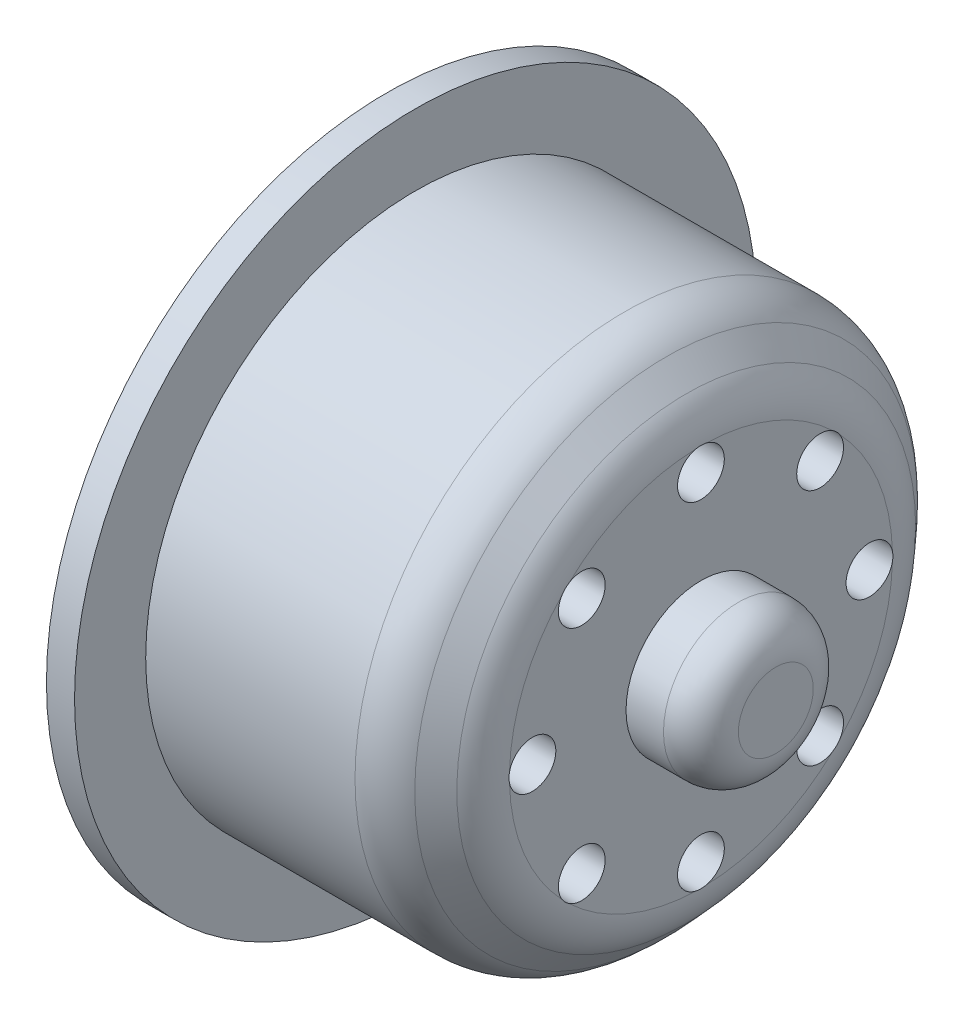
ISO-10303-21;
HEADER;
FILE_DESCRIPTION(('STEP AP214'),'2;1');
FILE_NAME('part.step','',(''),(''),'','','');
FILE_SCHEMA(('AUTOMOTIVE_DESIGN { 1 0 10303 214 1 1 1 1 }'));
ENDSEC;
DATA;
#1=APPLICATION_CONTEXT('core data for automotive mechanical design processes');
#2=APPLICATION_PROTOCOL_DEFINITION('international standard','automotive_design',2000,#1);
#3=PRODUCT_CONTEXT('',#1,'mechanical');
#4=PRODUCT('Part','Part','',(#3));
#5=PRODUCT_RELATED_PRODUCT_CATEGORY('part','',(#4));
#6=PRODUCT_DEFINITION_FORMATION('','',#4);
#7=PRODUCT_DEFINITION_CONTEXT('part definition',#1,'design');
#8=PRODUCT_DEFINITION('design','',#6,#7);
#9=PRODUCT_DEFINITION_SHAPE('','',#8);
#10=(LENGTH_UNIT() NAMED_UNIT(*) SI_UNIT(.MILLI.,.METRE.));
#11=(NAMED_UNIT(*) PLANE_ANGLE_UNIT() SI_UNIT($,.RADIAN.));
#12=(NAMED_UNIT(*) SI_UNIT($,.STERADIAN.) SOLID_ANGLE_UNIT());
#13=UNCERTAINTY_MEASURE_WITH_UNIT(LENGTH_MEASURE(1.E-05),#10,'distance_accuracy_value','');
#14=(GEOMETRIC_REPRESENTATION_CONTEXT(3) GLOBAL_UNCERTAINTY_ASSIGNED_CONTEXT((#13)) GLOBAL_UNIT_ASSIGNED_CONTEXT((#10,
#11,#12)) REPRESENTATION_CONTEXT('',''));
#15=CARTESIAN_POINT('',(0.,0.,0.));
#16=DIRECTION('',(0.,0.,1.));
#17=DIRECTION('',(1.,0.,0.));
#18=AXIS2_PLACEMENT_3D('',#15,#16,#17);
#19=CARTESIAN_POINT('',(-9.66596868854574,6.36396103067838,6.3639610306787));
#20=DIRECTION('',(1.,0.,0.));
#21=DIRECTION('',(0.,0.,-1.));
#22=AXIS2_PLACEMENT_3D('',#19,#20,#21);
#23=CYLINDRICAL_SURFACE('',#22,1.25000000000048);
#24=CARTESIAN_POINT('',(10.6195652173913,6.36396103067838,6.3639610306787));
#25=DIRECTION('',(1.,0.,0.));
#26=DIRECTION('',(0.,0.,-1.));
#27=AXIS2_PLACEMENT_3D('',#24,#25,#26);
#28=CIRCLE('',#27,1.25000000000048);
#29=CARTESIAN_POINT('',(10.6195652173913,7.04596741641522,7.41151403163636));
#30=VERTEX_POINT('',#29);
#31=CARTESIAN_POINT('',(10.6195652173913,7.411514031636,7.04596741641559));
#32=VERTEX_POINT('',#31);
#33=EDGE_CURVE('E143',#30,#32,#28,.T.);
#34=ORIENTED_EDGE('',*,*,#33,.T.);
#35=CARTESIAN_POINT('',(10.6195652173913,7.411514031636,7.04596741641559));
#36=CARTESIAN_POINT('',(10.6195631780049,7.3921665441352,7.07568123261779));
#37=CARTESIAN_POINT('',(10.6195450792208,7.37156780283131,7.10455609710923));
#38=CARTESIAN_POINT('',(10.6195060472776,7.32798836855858,7.16046028078622));
#39=CARTESIAN_POINT('',(10.6194851133993,7.30500707156565,7.18748912907579));
#40=CARTESIAN_POINT('',(10.6194623135887,7.23356505711365,7.26458438701048));
#41=CARTESIAN_POINT('',(10.6194982553825,7.18188988291681,7.31175467629777));
#42=CARTESIAN_POINT('',(10.6195444906783,7.10055561788832,7.37442318921318));
#43=CARTESIAN_POINT('',(10.6195583321452,7.07361016905411,7.3935317962861));
#44=CARTESIAN_POINT('',(10.6195652173913,7.04596741641522,7.41151403163636));
#45=B_SPLINE_CURVE_WITH_KNOTS('',3,(#35,#36,#37,#38,#39,#40,#41,#42,#43,#44),.UNSPECIFIED.,.F.,
.F.,(4,2,2,2,4),(0.,0.106299940745221,0.212626896795299,0.421403751994226,0.520384501001311),.UNSPECIFIED.);
#46=EDGE_CURVE('E49',#32,#30,#45,.T.);
#47=ORIENTED_EDGE('',*,*,#46,.T.);
#48=EDGE_LOOP('',(#34,#47));
#49=FACE_BOUND('',#48,.T.);
#50=CARTESIAN_POINT('',(5.61956521739131,6.36396103067838,6.3639610306787));
#51=DIRECTION('',(-1.,0.,0.));
#52=DIRECTION('',(0.,0.,1.));
#53=AXIS2_PLACEMENT_3D('',#50,#51,#52);
#54=CIRCLE('',#53,1.25000000000048);
#55=CARTESIAN_POINT('',(5.61956521739131,6.36396103067838,7.61396103067918));
#56=VERTEX_POINT('',#55);
#57=EDGE_CURVE('E145',#56,#56,#54,.F.);
#58=ORIENTED_EDGE('',*,*,#57,.F.);
#59=EDGE_LOOP('',(#58));
#60=FACE_BOUND('',#59,.T.);
#61=ADVANCED_FACE('F35',(#49,#60),#23,.F.);
#62=CARTESIAN_POINT('',(-9.66596868854574,-7.66835063561292E-13,8.99999999999923));
#63=DIRECTION('',(1.,0.,0.));
#64=DIRECTION('',(0.,0.,-1.));
#65=AXIS2_PLACEMENT_3D('',#62,#63,#64);
#66=CYLINDRICAL_SURFACE('',#65,1.25000000000105);
#67=CARTESIAN_POINT('',(10.6195652173913,-7.66835063561292E-13,8.99999999999923));
#68=DIRECTION('',(1.,0.,0.));
#69=DIRECTION('',(0.,0.,-1.));
#70=AXIS2_PLACEMENT_3D('',#67,#68,#69);
#71=CIRCLE('',#70,1.25000000000105);
#72=CARTESIAN_POINT('',(10.6195652173913,-0.258480490465189,10.2229831707959));
#73=VERTEX_POINT('',#72);
#74=CARTESIAN_POINT('',(10.6195652173913,0.258480490463447,10.222983170796));
#75=VERTEX_POINT('',#74);
#76=EDGE_CURVE('E140',#73,#75,#71,.T.);
#77=ORIENTED_EDGE('',*,*,#76,.T.);
#78=CARTESIAN_POINT('',(10.6195652173913,0.258480490463447,10.222983170796));
#79=CARTESIAN_POINT('',(10.6195631780049,0.223788909921195,10.2303132721168));
#80=CARTESIAN_POINT('',(10.6195450792208,0.188805787773558,10.2361653749447));
#81=CARTESIAN_POINT('',(10.6195060472776,0.118460246904311,10.244880288825));
#82=CARTESIAN_POINT('',(10.6194851133993,0.0830977340469196,10.2477423397941));
#83=CARTESIAN_POINT('',(10.6194623135887,-0.021933978516702,10.2517397865965));
#84=CARTESIAN_POINT('',(10.6194982553825,-0.0918282760358895,10.2485543519286));
#85=CARTESIAN_POINT('',(10.6195444906783,-0.193653616830998,10.2353556720335));
#86=CARTESIAN_POINT('',(10.6195583321452,-0.226218752065304,10.2298141880808));
#87=CARTESIAN_POINT('',(10.6195652173913,-0.258480490465189,10.2229831707959));
#88=B_SPLINE_CURVE_WITH_KNOTS('',3,(#78,#79,#80,#81,#82,#83,#84,#85,#86,#87),.UNSPECIFIED.,.F.,
.F.,(4,2,2,2,4),(0.,0.106299940745276,0.212626896795408,0.421403751994417,0.520384501005222),.UNSPECIFIED.);
#89=EDGE_CURVE('E281',#75,#73,#88,.T.);
#90=ORIENTED_EDGE('',*,*,#89,.T.);
#91=EDGE_LOOP('',(#77,#90));
#92=FACE_BOUND('',#91,.T.);
#93=CARTESIAN_POINT('',(5.61956521739131,-7.66835063561292E-13,8.99999999999923));
#94=DIRECTION('',(-1.,0.,0.));
#95=DIRECTION('',(0.,0.,1.));
#96=AXIS2_PLACEMENT_3D('',#93,#94,#95);
#97=CIRCLE('',#96,1.25000000000105);
#98=CARTESIAN_POINT('',(5.61956521739131,-7.66835063561292E-13,10.2500000000003));
#99=VERTEX_POINT('',#98);
#100=EDGE_CURVE('E185',#99,#99,#97,.F.);
#101=ORIENTED_EDGE('',*,*,#100,.F.);
#102=EDGE_LOOP('',(#101));
#103=FACE_BOUND('',#102,.T.);
#104=ADVANCED_FACE('F273',(#92,#103),#66,.F.);
#105=CARTESIAN_POINT('',(-9.66596868854574,-6.36396103067947,6.36396103067762));
#106=DIRECTION('',(1.,0.,0.));
#107=DIRECTION('',(0.,0.,-1.));
#108=AXIS2_PLACEMENT_3D('',#105,#106,#107);
#109=CYLINDRICAL_SURFACE('',#108,1.25000000000148);
#110=CARTESIAN_POINT('',(10.6195652173913,-6.36396103067947,6.36396103067762));
#111=DIRECTION('',(1.,0.,0.));
#112=DIRECTION('',(0.,0.,-1.));
#113=AXIS2_PLACEMENT_3D('',#110,#111,#112);
#114=CIRCLE('',#113,1.25000000000148);
#115=CARTESIAN_POINT('',(10.6195652173913,-7.41151403164101,7.04596741641032));
#116=VERTEX_POINT('',#115);
#117=CARTESIAN_POINT('',(10.6195652173913,-7.04596741641248,7.41151403163896));
#118=VERTEX_POINT('',#117);
#119=EDGE_CURVE('E137',#116,#118,#114,.T.);
#120=ORIENTED_EDGE('',*,*,#119,.T.);
#121=CARTESIAN_POINT('',(10.6195652173913,-7.04596741641248,7.41151403163896));
#122=CARTESIAN_POINT('',(10.6195631780049,-7.07568123261479,7.39216654413827));
#123=CARTESIAN_POINT('',(10.6195450792208,-7.10455609710634,7.37156780283448));
#124=CARTESIAN_POINT('',(10.6195060472776,-7.16046028078358,7.32798836856194));
#125=CARTESIAN_POINT('',(10.6194851133993,-7.18748912907327,7.3050070715691));
#126=CARTESIAN_POINT('',(10.6194623135887,-7.26458438700831,7.23356505711737));
#127=CARTESIAN_POINT('',(10.6194982553825,-7.31175467629584,7.1818898829207));
#128=CARTESIAN_POINT('',(10.6195444906783,-7.37442318921385,7.10055561788955));
#129=CARTESIAN_POINT('',(10.6195583321452,-7.39353179628889,7.07361016905235));
#130=CARTESIAN_POINT('',(10.6195652173913,-7.41151403164101,7.04596741641032));
#131=B_SPLINE_CURVE_WITH_KNOTS('',3,(#121,#122,#123,#124,#125,#126,#127,#128,#129,#130),
.UNSPECIFIED.,.F.,.F.,(4,2,2,2,4),(0.,0.106299940745328,0.212626896795508,0.421403751994564,
0.520384501012581),.UNSPECIFIED.);
#132=EDGE_CURVE('E276',#118,#116,#131,.T.);
#133=ORIENTED_EDGE('',*,*,#132,.T.);
#134=EDGE_LOOP('',(#120,#133));
#135=FACE_BOUND('',#134,.T.);
#136=CARTESIAN_POINT('',(5.61956521739131,-6.36396103067947,6.36396103067762));
#137=DIRECTION('',(-1.,0.,0.));
#138=DIRECTION('',(0.,0.,1.));
#139=AXIS2_PLACEMENT_3D('',#136,#137,#138);
#140=CIRCLE('',#139,1.25000000000148);
#141=CARTESIAN_POINT('',(5.61956521739131,-6.36396103067947,7.6139610306791));
#142=VERTEX_POINT('',#141);
#143=EDGE_CURVE('E182',#142,#142,#140,.F.);
#144=ORIENTED_EDGE('',*,*,#143,.F.);
#145=EDGE_LOOP('',(#144));
#146=FACE_BOUND('',#145,.T.);
#147=ADVANCED_FACE('F268',(#135,#146),#109,.F.);
#148=CARTESIAN_POINT('',(-9.66596868854574,-9.,-1.53146576288412E-12));
#149=DIRECTION('',(1.,0.,0.));
#150=DIRECTION('',(0.,0.,-1.));
#151=AXIS2_PLACEMENT_3D('',#148,#149,#150);
#152=CYLINDRICAL_SURFACE('',#151,1.25000000000152);
#153=CARTESIAN_POINT('',(10.6195652173913,-9.,-1.53146576288412E-12));
#154=DIRECTION('',(1.,0.,0.));
#155=DIRECTION('',(0.,0.,-1.));
#156=AXIS2_PLACEMENT_3D('',#153,#154,#155);
#157=CIRCLE('',#156,1.25000000000152);
#158=CARTESIAN_POINT('',(10.6195652173913,-10.2229831707957,-0.258480490472793));
#159=VERTEX_POINT('',#158);
#160=CARTESIAN_POINT('',(10.6195652173913,-10.2229831707958,0.258480490469314));
#161=VERTEX_POINT('',#160);
#162=EDGE_CURVE('E134',#159,#161,#157,.T.);
#163=ORIENTED_EDGE('',*,*,#162,.T.);
#164=CARTESIAN_POINT('',(10.6195652173913,-10.2229831707958,0.258480490469314));
#165=CARTESIAN_POINT('',(10.6195631780049,-10.2303132721168,0.223788909927081));
#166=CARTESIAN_POINT('',(10.6195450792208,-10.2361653749449,0.188805787779453));
#167=CARTESIAN_POINT('',(10.6195060472776,-10.2448802888256,0.118460246910208));
#168=CARTESIAN_POINT('',(10.6194851133993,-10.2477423397949,0.0830977340528114));
#169=CARTESIAN_POINT('',(10.6194623135887,-10.2517397865979,-0.0219339785108185));
#170=CARTESIAN_POINT('',(10.6194982553825,-10.2485543519303,-0.0918282760300287));
#171=CARTESIAN_POINT('',(10.6195444906783,-10.2353556720352,-0.193653616829725));
#172=CARTESIAN_POINT('',(10.6195583321452,-10.2298141880817,-0.226218752068514));
#173=CARTESIAN_POINT('',(10.6195652173913,-10.2229831707957,-0.258480490472793));
#174=B_SPLINE_CURVE_WITH_KNOTS('',3,(#164,#165,#166,#167,#168,#169,#170,#171,#172,#173),
.UNSPECIFIED.,.F.,.F.,(4,2,2,2,4),(0.,0.106299940745344,0.212626896795537,0.421403751994579,
0.520384501018977),.UNSPECIFIED.);
#175=EDGE_CURVE('E253',#161,#159,#174,.T.);
#176=ORIENTED_EDGE('',*,*,#175,.T.);
#177=EDGE_LOOP('',(#163,#176));
#178=FACE_BOUND('',#177,.T.);
#179=CARTESIAN_POINT('',(5.61956521739131,-9.,-1.53146576288412E-12));
#180=DIRECTION('',(-1.,0.,0.));
#181=DIRECTION('',(0.,0.,1.));
#182=AXIS2_PLACEMENT_3D('',#179,#180,#181);
#183=CIRCLE('',#182,1.25000000000152);
#184=CARTESIAN_POINT('',(5.61956521739131,-9.,1.24999999999999));
#185=VERTEX_POINT('',#184);
#186=EDGE_CURVE('E179',#185,#185,#183,.F.);
#187=ORIENTED_EDGE('',*,*,#186,.F.);
#188=EDGE_LOOP('',(#187));
#189=FACE_BOUND('',#188,.T.);
#190=ADVANCED_FACE('F263',(#178,#189),#152,.F.);
#191=CARTESIAN_POINT('',(-9.66596868854574,-6.36396103067839,-6.36396103068023));
#192=DIRECTION('',(1.,0.,0.));
#193=DIRECTION('',(0.,0.,-1.));
#194=AXIS2_PLACEMENT_3D('',#191,#192,#193);
#195=CYLINDRICAL_SURFACE('',#194,1.25000000000114);
#196=CARTESIAN_POINT('',(10.6195652173913,-6.36396103067839,-6.36396103068023));
#197=DIRECTION('',(1.,0.,0.));
#198=DIRECTION('',(0.,0.,-1.));
#199=AXIS2_PLACEMENT_3D('',#196,#197,#198);
#200=CIRCLE('',#199,1.25000000000114);
#201=CARTESIAN_POINT('',(10.6195652173913,-7.04596741640749,-7.4115140316437));
#202=VERTEX_POINT('',#201);
#203=CARTESIAN_POINT('',(10.6195652173913,-7.41151403164166,-7.04596741640964));
#204=VERTEX_POINT('',#203);
#205=EDGE_CURVE('E131',#202,#204,#200,.T.);
#206=ORIENTED_EDGE('',*,*,#205,.T.);
#207=CARTESIAN_POINT('',(10.6195652173913,-7.41151403164166,-7.04596741640964));
#208=CARTESIAN_POINT('',(10.6195631780049,-7.39216654414107,-7.07568123261201));
#209=CARTESIAN_POINT('',(10.6195450792208,-7.37156780283737,-7.10455609710363));
#210=CARTESIAN_POINT('',(10.6195060472776,-7.32798836856502,-7.160460280781));
#211=CARTESIAN_POINT('',(10.6194851133993,-7.30500707157227,-7.18748912907076));
#212=CARTESIAN_POINT('',(10.6194623135887,-7.23356505712082,-7.26458438700601));
#213=CARTESIAN_POINT('',(10.6194982553825,-7.18188988292432,-7.31175467629368));
#214=CARTESIAN_POINT('',(10.6195444906783,-7.10055561789125,-7.3744231892136));
#215=CARTESIAN_POINT('',(10.6195583321452,-7.07361016905184,-7.3935317962902));
#216=CARTESIAN_POINT('',(10.6195652173913,-7.04596741640749,-7.4115140316437));
#217=B_SPLINE_CURVE_WITH_KNOTS('',3,(#207,#208,#209,#210,#211,#212,#213,#214,#215,#216),
.UNSPECIFIED.,.F.,.F.,(4,2,2,2,4),(0.,0.106299940745316,0.212626896795477,0.421403751994447,
0.520384501020571),.UNSPECIFIED.);
#218=EDGE_CURVE('E247',#204,#202,#217,.T.);
#219=ORIENTED_EDGE('',*,*,#218,.T.);
#220=EDGE_LOOP('',(#206,#219));
#221=FACE_BOUND('',#220,.T.);
#222=CARTESIAN_POINT('',(5.61956521739131,-6.36396103067839,-6.36396103068023));
#223=DIRECTION('',(-1.,0.,0.));
#224=DIRECTION('',(0.,0.,1.));
#225=AXIS2_PLACEMENT_3D('',#222,#223,#224);
#226=CIRCLE('',#225,1.25000000000114);
#227=CARTESIAN_POINT('',(5.61956521739131,-6.36396103067839,-5.1139610306791));
#228=VERTEX_POINT('',#227);
#229=EDGE_CURVE('E176',#228,#228,#226,.F.);
#230=ORIENTED_EDGE('',*,*,#229,.F.);
#231=EDGE_LOOP('',(#230));
#232=FACE_BOUND('',#231,.T.);
#233=ADVANCED_FACE('F260',(#221,#232),#195,.F.);
#234=CARTESIAN_POINT('',(-9.66596868854574,7.65732881442059E-13,-9.00000000000076));
#235=DIRECTION('',(1.,0.,0.));
#236=DIRECTION('',(0.,0.,-1.));
#237=AXIS2_PLACEMENT_3D('',#234,#235,#236);
#238=CYLINDRICAL_SURFACE('',#237,1.25000000000054);
#239=CARTESIAN_POINT('',(10.6195652173913,7.65732881442059E-13,-9.00000000000076));
#240=DIRECTION('',(1.,0.,0.));
#241=DIRECTION('',(0.,0.,-1.));
#242=AXIS2_PLACEMENT_3D('',#239,#240,#241);
#243=CIRCLE('',#242,1.25000000000054);
#244=CARTESIAN_POINT('',(10.6195652173913,0.258480490470619,-10.2229831707958));
#245=VERTEX_POINT('',#244);
#246=CARTESIAN_POINT('',(10.6195652173913,-0.258480490468879,-10.2229831707958));
#247=VERTEX_POINT('',#246);
#248=EDGE_CURVE('E123',#245,#247,#243,.T.);
#249=ORIENTED_EDGE('',*,*,#248,.T.);
#250=CARTESIAN_POINT('',(10.6195652173913,-0.258480490468879,-10.2229831707958));
#251=CARTESIAN_POINT('',(10.6195631780049,-0.223788909926669,-10.2303132721168));
#252=CARTESIAN_POINT('',(10.6195450792208,-0.188805787779065,-10.2361653749449));
#253=CARTESIAN_POINT('',(10.6195060472776,-0.118460246909872,-10.2448802888255));
#254=CARTESIAN_POINT('',(10.6194851133993,-0.0830977340525016,-10.2477423397947));
#255=CARTESIAN_POINT('',(10.6194623135887,0.0219339785110503,-10.2517397865976));
#256=CARTESIAN_POINT('',(10.6194982553825,0.0918282760302062,-10.24855435193));
#257=CARTESIAN_POINT('',(10.6195444906783,0.193653616829069,-10.2353556720349));
#258=CARTESIAN_POINT('',(10.6195583321452,0.226218752067091,-10.2298141880816));
#259=CARTESIAN_POINT('',(10.6195652173913,0.258480490470619,-10.2229831707958));
#260=B_SPLINE_CURVE_WITH_KNOTS('',3,(#250,#251,#252,#253,#254,#255,#256,#257,#258,#259),
.UNSPECIFIED.,.F.,.F.,(4,2,2,2,4),(0.,0.106299940745255,0.212626896795361,0.421403751994246,
0.520384501016319),.UNSPECIFIED.);
#261=EDGE_CURVE('E241',#247,#245,#260,.T.);
#262=ORIENTED_EDGE('',*,*,#261,.T.);
#263=EDGE_LOOP('',(#249,#262));
#264=FACE_BOUND('',#263,.T.);
#265=CARTESIAN_POINT('',(5.61956521739131,7.65732881442059E-13,-9.00000000000076));
#266=DIRECTION('',(-1.,0.,0.));
#267=DIRECTION('',(0.,0.,1.));
#268=AXIS2_PLACEMENT_3D('',#265,#266,#267);
#269=CIRCLE('',#268,1.25000000000054);
#270=CARTESIAN_POINT('',(5.61956521739131,7.65732881442059E-13,-7.75000000000023));
#271=VERTEX_POINT('',#270);
#272=EDGE_CURVE('E173',#271,#271,#269,.F.);
#273=ORIENTED_EDGE('',*,*,#272,.F.);
#274=EDGE_LOOP('',(#273));
#275=FACE_BOUND('',#274,.T.);
#276=ADVANCED_FACE('F232',(#264,#275),#238,.F.);
#277=CARTESIAN_POINT('',(-9.66596868854574,6.36396103067947,-6.36396103067915));
#278=DIRECTION('',(1.,0.,0.));
#279=DIRECTION('',(0.,0.,-1.));
#280=AXIS2_PLACEMENT_3D('',#277,#278,#279);
#281=CYLINDRICAL_SURFACE('',#280,1.25000000000007);
#282=CARTESIAN_POINT('',(10.6195652173913,6.36396103067947,-6.36396103067915));
#283=DIRECTION('',(1.,0.,0.));
#284=DIRECTION('',(0.,0.,-1.));
#285=AXIS2_PLACEMENT_3D('',#282,#283,#284);
#286=CIRCLE('',#285,1.25000000000007);
#287=CARTESIAN_POINT('',(10.6195652173913,7.41151403163883,-7.04596741641262));
#288=VERTEX_POINT('',#287);
#289=CARTESIAN_POINT('',(10.6195652173913,7.04596741641299,-7.41151403163847));
#290=VERTEX_POINT('',#289);
#291=EDGE_CURVE('E114',#288,#290,#286,.T.);
#292=ORIENTED_EDGE('',*,*,#291,.T.);
#293=CARTESIAN_POINT('',(10.6195652173913,7.04596741641299,-7.41151403163847));
#294=CARTESIAN_POINT('',(10.6195631780049,7.07568123261524,-7.39216654413777));
#295=CARTESIAN_POINT('',(10.6195450792208,7.10455609710673,-7.37156780283397));
#296=CARTESIAN_POINT('',(10.6195060472776,7.16046028078385,-7.32798836856141));
#297=CARTESIAN_POINT('',(10.6194851133993,7.18748912907348,-7.30500707156857));
#298=CARTESIAN_POINT('',(10.6194623135887,7.26458438700835,-7.23356505711683));
#299=CARTESIAN_POINT('',(10.6194982553825,7.31175467629577,-7.18188988292015));
#300=CARTESIAN_POINT('',(10.6195444906783,7.37442318921293,-7.1005556178899));
#301=CARTESIAN_POINT('',(10.6195583321452,7.3935317962873,-7.07361016905365));
#302=CARTESIAN_POINT('',(10.6195652173913,7.41151403163883,-7.04596741641262));
#303=B_SPLINE_CURVE_WITH_KNOTS('',3,(#293,#294,#295,#296,#297,#298,#299,#300,#301,#302),
.UNSPECIFIED.,.F.,.F.,(4,2,2,2,4),(0.,0.106299940745201,0.212626896795256,0.421403751994088,
0.520384501008637),.UNSPECIFIED.);
#304=EDGE_CURVE('E43',#290,#288,#303,.T.);
#305=ORIENTED_EDGE('',*,*,#304,.T.);
#306=EDGE_LOOP('',(#292,#305));
#307=FACE_BOUND('',#306,.T.);
#308=CARTESIAN_POINT('',(5.61956521739131,6.36396103067947,-6.36396103067915));
#309=DIRECTION('',(-1.,0.,0.));
#310=DIRECTION('',(0.,0.,1.));
#311=AXIS2_PLACEMENT_3D('',#308,#309,#310);
#312=CIRCLE('',#311,1.25000000000007);
#313=CARTESIAN_POINT('',(5.61956521739131,6.36396103067947,-5.11396103067908));
#314=VERTEX_POINT('',#313);
#315=EDGE_CURVE('E170',#314,#314,#312,.F.);
#316=ORIENTED_EDGE('',*,*,#315,.F.);
#317=EDGE_LOOP('',(#316));
#318=FACE_BOUND('',#317,.T.);
#319=ADVANCED_FACE('F226',(#307,#318),#281,.F.);
#320=CARTESIAN_POINT('',(-9.66596868854574,9.,0.));
#321=DIRECTION('',(1.,0.,0.));
#322=DIRECTION('',(0.,0.,-1.));
#323=AXIS2_PLACEMENT_3D('',#320,#321,#322);
#324=CYLINDRICAL_SURFACE('',#323,1.25);
#325=CARTESIAN_POINT('',(10.6195652173913,9.,0.));
#326=DIRECTION('',(1.,0.,0.));
#327=DIRECTION('',(0.,0.,-1.));
#328=AXIS2_PLACEMENT_3D('',#325,#326,#327);
#329=CIRCLE('',#328,1.25);
#330=CARTESIAN_POINT('',(10.6195652173913,10.222983170796,0.258480490462679));
#331=VERTEX_POINT('',#330);
#332=CARTESIAN_POINT('',(10.6195652173913,10.222983170796,-0.258480490462679));
#333=VERTEX_POINT('',#332);
#334=EDGE_CURVE('E112',#331,#333,#329,.T.);
#335=ORIENTED_EDGE('',*,*,#334,.T.);
#336=CARTESIAN_POINT('',(10.6195652173913,10.222983170796,-0.258480490462679));
#337=CARTESIAN_POINT('',(10.6195631780049,10.2303132721168,-0.223788909920451));
#338=CARTESIAN_POINT('',(10.6195450792208,10.2361653749446,-0.188805787772839));
#339=CARTESIAN_POINT('',(10.6195060472776,10.2448802888248,-0.118460246903644));
#340=CARTESIAN_POINT('',(10.6194851133993,10.2477423397939,-0.083097734046281));
#341=CARTESIAN_POINT('',(10.6194623135887,10.2517397865962,0.0219339785172594));
#342=CARTESIAN_POINT('',(10.6194982553825,10.2485543519282,0.0918282760363895));
#343=CARTESIAN_POINT('',(10.6195444906783,10.2353556720331,0.193653616830439));
#344=CARTESIAN_POINT('',(10.6195583321452,10.2298141880806,0.22621875206376));
#345=CARTESIAN_POINT('',(10.6195652173913,10.222983170796,0.258480490462679));
#346=B_SPLINE_CURVE_WITH_KNOTS('',3,(#336,#337,#338,#339,#340,#341,#342,#343,#344,#345),
.UNSPECIFIED.,.F.,.F.,(4,2,2,2,4),(0.,0.106299940745182,0.21262689679522,0.421403751994065,
0.520384501001881),.UNSPECIFIED.);
#347=EDGE_CURVE('E100',#333,#331,#346,.T.);
#348=ORIENTED_EDGE('',*,*,#347,.T.);
#349=EDGE_LOOP('',(#335,#348));
#350=FACE_BOUND('',#349,.T.);
#351=CARTESIAN_POINT('',(5.61956521739131,9.,0.));
#352=DIRECTION('',(-1.,0.,0.));
#353=DIRECTION('',(0.,0.,1.));
#354=AXIS2_PLACEMENT_3D('',#351,#352,#353);
#355=CIRCLE('',#354,1.25);
#356=CARTESIAN_POINT('',(5.61956521739131,9.,1.25));
#357=VERTEX_POINT('',#356);
#358=EDGE_CURVE('E167',#357,#357,#355,.F.);
#359=ORIENTED_EDGE('',*,*,#358,.F.);
#360=EDGE_LOOP('',(#359));
#361=FACE_BOUND('',#360,.T.);
#362=ADVANCED_FACE('F116',(#350,#361),#324,.F.);
#363=CARTESIAN_POINT('',(-4.6304347826087,0.,-14.4));
#364=DIRECTION('',(-1.,0.,0.));
#365=DIRECTION('',(0.,0.,1.));
#366=AXIS2_PLACEMENT_3D('',#363,#364,#365);
#367=PLANE('',#366);
#368=CARTESIAN_POINT('',(-4.6304347826087,0.,0.));
#369=DIRECTION('',(-1.,0.,0.));
#370=DIRECTION('',(0.,0.,1.));
#371=AXIS2_PLACEMENT_3D('',#368,#369,#370);
#372=CIRCLE('',#371,18.2);
#373=CARTESIAN_POINT('',(-4.6304347826087,0.,18.2));
#374=VERTEX_POINT('',#373);
#375=EDGE_CURVE('E157',#374,#374,#372,.T.);
#376=ORIENTED_EDGE('',*,*,#375,.F.);
#377=EDGE_LOOP('',(#376));
#378=FACE_BOUND('',#377,.T.);
#379=CARTESIAN_POINT('',(-4.6304347826087,0.,0.));
#380=DIRECTION('',(-1.,0.,0.));
#381=DIRECTION('',(0.,0.,1.));
#382=AXIS2_PLACEMENT_3D('',#379,#380,#381);
#383=CIRCLE('',#382,14.4);
#384=CARTESIAN_POINT('',(-4.6304347826087,0.,14.4));
#385=VERTEX_POINT('',#384);
#386=EDGE_CURVE('E147',#385,#385,#383,.T.);
#387=ORIENTED_EDGE('',*,*,#386,.T.);
#388=EDGE_LOOP('',(#387));
#389=FACE_BOUND('',#388,.T.);
#390=ADVANCED_FACE('F225',(#378,#389),#367,.F.);
#391=CARTESIAN_POINT('',(-12.3913043478261,0.,0.));
#392=DIRECTION('',(-1.,0.,0.));
#393=DIRECTION('',(0.,0.,1.));
#394=AXIS2_PLACEMENT_3D('',#391,#392,#393);
#395=CYLINDRICAL_SURFACE('',#394,18.2);
#396=CARTESIAN_POINT('',(-6.1304347826087,0.,0.));
#397=DIRECTION('',(-1.,0.,0.));
#398=DIRECTION('',(0.,0.,1.));
#399=AXIS2_PLACEMENT_3D('',#396,#397,#398);
#400=CIRCLE('',#399,18.2);
#401=CARTESIAN_POINT('',(-6.1304347826087,0.,18.2));
#402=VERTEX_POINT('',#401);
#403=EDGE_CURVE('E154',#402,#402,#400,.T.);
#404=ORIENTED_EDGE('',*,*,#403,.F.);
#405=EDGE_LOOP('',(#404));
#406=FACE_BOUND('',#405,.T.);
#407=ORIENTED_EDGE('',*,*,#375,.T.);
#408=EDGE_LOOP('',(#407));
#409=FACE_BOUND('',#408,.T.);
#410=ADVANCED_FACE('F362',(#406,#409),#395,.T.);
#411=CARTESIAN_POINT('',(-6.13043478260869,0.,-18.2));
#412=DIRECTION('',(1.,0.,0.));
#413=DIRECTION('',(0.,0.,-1.));
#414=AXIS2_PLACEMENT_3D('',#411,#412,#413);
#415=PLANE('',#414);
#416=CARTESIAN_POINT('',(-6.13043478260869,6.36396103067784,-6.36396103067848));
#417=DIRECTION('',(-1.,0.,0.));
#418=DIRECTION('',(0.,0.,1.));
#419=AXIS2_PLACEMENT_3D('',#416,#417,#418);
#420=CIRCLE('',#419,2.50000000000085);
#421=CARTESIAN_POINT('',(-6.13043478260869,6.36396103067784,-3.86396103067763));
#422=VERTEX_POINT('',#421);
#423=EDGE_CURVE('E703',#422,#422,#420,.T.);
#424=ORIENTED_EDGE('',*,*,#423,.F.);
#425=EDGE_LOOP('',(#424));
#426=FACE_BOUND('',#425,.T.);
#427=CARTESIAN_POINT('',(-6.13043478260869,-1.5342212181822E-12,-8.99999999999847));
#428=DIRECTION('',(-1.,0.,0.));
#429=DIRECTION('',(0.,0.,1.));
#430=AXIS2_PLACEMENT_3D('',#427,#428,#429);
#431=CIRCLE('',#430,2.50000000000201);
#432=CARTESIAN_POINT('',(-6.13043478260869,-1.5342212181822E-12,-6.49999999999646));
#433=VERTEX_POINT('',#432);
#434=EDGE_CURVE('E697',#433,#433,#431,.T.);
#435=ORIENTED_EDGE('',*,*,#434,.F.);
#436=EDGE_LOOP('',(#435));
#437=FACE_BOUND('',#436,.T.);
#438=CARTESIAN_POINT('',(-6.13043478260869,-6.36396103068001,-6.36396103067631));
#439=DIRECTION('',(-1.,0.,0.));
#440=DIRECTION('',(0.,0.,1.));
#441=AXIS2_PLACEMENT_3D('',#438,#439,#440);
#442=CIRCLE('',#441,2.5000000000029);
#443=CARTESIAN_POINT('',(-6.13043478260869,-6.36396103068001,-3.86396103067342));
#444=VERTEX_POINT('',#443);
#445=EDGE_CURVE('E691',#444,#444,#442,.T.);
#446=ORIENTED_EDGE('',*,*,#445,.F.);
#447=EDGE_LOOP('',(#446));
#448=FACE_BOUND('',#447,.T.);
#449=CARTESIAN_POINT('',(-6.13043478260869,-9.,3.06623807212593E-12));
#450=DIRECTION('',(-1.,0.,0.));
#451=DIRECTION('',(0.,0.,1.));
#452=AXIS2_PLACEMENT_3D('',#449,#450,#451);
#453=CIRCLE('',#452,2.50000000000299);
#454=CARTESIAN_POINT('',(-6.13043478260869,-9.,2.50000000000606));
#455=VERTEX_POINT('',#454);
#456=EDGE_CURVE('E685',#455,#455,#453,.T.);
#457=ORIENTED_EDGE('',*,*,#456,.F.);
#458=EDGE_LOOP('',(#457));
#459=FACE_BOUND('',#458,.T.);
#460=CARTESIAN_POINT('',(-6.13043478260869,-6.36396103067784,6.36396103068154));
#461=DIRECTION('',(-1.,0.,0.));
#462=DIRECTION('',(0.,0.,1.));
#463=AXIS2_PLACEMENT_3D('',#460,#461,#462);
#464=CIRCLE('',#463,2.50000000000223);
#465=CARTESIAN_POINT('',(-6.13043478260869,-6.36396103067784,8.86396103068378));
#466=VERTEX_POINT('',#465);
#467=EDGE_CURVE('E679',#466,#466,#464,.T.);
#468=ORIENTED_EDGE('',*,*,#467,.F.);
#469=EDGE_LOOP('',(#468));
#470=FACE_BOUND('',#469,.T.);
#471=CARTESIAN_POINT('',(-6.13043478260869,1.53311903606297E-12,9.00000000000153));
#472=DIRECTION('',(-1.,0.,0.));
#473=DIRECTION('',(0.,0.,1.));
#474=AXIS2_PLACEMENT_3D('',#471,#472,#473);
#475=CIRCLE('',#474,2.50000000000105);
#476=CARTESIAN_POINT('',(-6.13043478260869,1.53311903606297E-12,11.5000000000026));
#477=VERTEX_POINT('',#476);
#478=EDGE_CURVE('E673',#477,#477,#475,.T.);
#479=ORIENTED_EDGE('',*,*,#478,.F.);
#480=EDGE_LOOP('',(#479));
#481=FACE_BOUND('',#480,.T.);
#482=CARTESIAN_POINT('',(-6.13043478260869,6.36396103068001,6.36396103067938));
#483=DIRECTION('',(-1.,0.,0.));
#484=DIRECTION('',(0.,0.,1.));
#485=AXIS2_PLACEMENT_3D('',#482,#483,#484);
#486=CIRCLE('',#485,2.50000000000013);
#487=CARTESIAN_POINT('',(-6.13043478260869,6.36396103068001,8.8639610306795));
#488=VERTEX_POINT('',#487);
#489=EDGE_CURVE('E666',#488,#488,#486,.T.);
#490=ORIENTED_EDGE('',*,*,#489,.F.);
#491=EDGE_LOOP('',(#490));
#492=FACE_BOUND('',#491,.T.);
#493=CARTESIAN_POINT('',(-6.13043478260869,9.,0.));
#494=DIRECTION('',(-1.,0.,0.));
#495=DIRECTION('',(0.,0.,1.));
#496=AXIS2_PLACEMENT_3D('',#493,#494,#495);
#497=CIRCLE('',#496,2.5);
#498=CARTESIAN_POINT('',(-6.13043478260869,9.,2.5));
#499=VERTEX_POINT('',#498);
#500=EDGE_CURVE('E670',#499,#499,#497,.T.);
#501=ORIENTED_EDGE('',*,*,#500,.F.);
#502=EDGE_LOOP('',(#501));
#503=FACE_BOUND('',#502,.T.);
#504=CARTESIAN_POINT('',(-6.13043478260869,0.,0.));
#505=DIRECTION('',(-1.,0.,0.));
#506=DIRECTION('',(0.,0.,1.));
#507=AXIS2_PLACEMENT_3D('',#504,#505,#506);
#508=CIRCLE('',#507,5.6);
#509=CARTESIAN_POINT('',(-6.13043478260869,0.,5.6));
#510=VERTEX_POINT('',#509);
#511=EDGE_CURVE('E118',#510,#510,#508,.T.);
#512=ORIENTED_EDGE('',*,*,#511,.F.);
#513=EDGE_LOOP('',(#512));
#514=FACE_BOUND('',#513,.T.);
#515=ORIENTED_EDGE('',*,*,#403,.T.);
#516=EDGE_LOOP('',(#515));
#517=FACE_BOUND('',#516,.T.);
#518=ADVANCED_FACE('F358',(#426,#437,#448,#459,#470,#481,#492,#503,#514,#517),#415,.F.);
#519=CARTESIAN_POINT('',(14.6195652173913,0.,-4.));
#520=DIRECTION('',(-1.,0.,0.));
#521=DIRECTION('',(0.,0.,1.));
#522=AXIS2_PLACEMENT_3D('',#519,#520,#521);
#523=PLANE('',#522);
#524=CARTESIAN_POINT('',(14.6195652173913,0.,0.));
#525=DIRECTION('',(-1.,0.,0.));
#526=DIRECTION('',(0.,0.,1.));
#527=AXIS2_PLACEMENT_3D('',#524,#525,#526);
#528=CIRCLE('',#527,2.);
#529=CARTESIAN_POINT('',(14.6195652173913,0.,2.));
#530=VERTEX_POINT('',#529);
#531=EDGE_CURVE('E163',#530,#530,#528,.F.);
#532=ORIENTED_EDGE('',*,*,#531,.T.);
#533=EDGE_LOOP('',(#532));
#534=FACE_BOUND('',#533,.T.);
#535=ADVANCED_FACE('F354',(#534),#523,.F.);
#536=CARTESIAN_POINT('',(-12.3913043478261,0.,0.));
#537=DIRECTION('',(-1.,0.,0.));
#538=DIRECTION('',(0.,0.,1.));
#539=AXIS2_PLACEMENT_3D('',#536,#537,#538);
#540=CYLINDRICAL_SURFACE('',#539,4.);
#541=CARTESIAN_POINT('',(12.6195652173913,0.,0.));
#542=DIRECTION('',(-1.,0.,0.));
#543=DIRECTION('',(0.,0.,1.));
#544=AXIS2_PLACEMENT_3D('',#541,#542,#543);
#545=CIRCLE('',#544,4.);
#546=CARTESIAN_POINT('',(12.6195652173913,0.,4.));
#547=VERTEX_POINT('',#546);
#548=EDGE_CURVE('E160',#547,#547,#545,.T.);
#549=ORIENTED_EDGE('',*,*,#548,.T.);
#550=EDGE_LOOP('',(#549));
#551=FACE_BOUND('',#550,.T.);
#552=CARTESIAN_POINT('',(10.6195652173913,0.,0.));
#553=DIRECTION('',(-1.,0.,0.));
#554=DIRECTION('',(0.,0.,1.));
#555=AXIS2_PLACEMENT_3D('',#552,#553,#554);
#556=CIRCLE('',#555,4.);
#557=CARTESIAN_POINT('',(10.6195652173913,0.,4.));
#558=VERTEX_POINT('',#557);
#559=EDGE_CURVE('E151',#558,#558,#556,.T.);
#560=ORIENTED_EDGE('',*,*,#559,.F.);
#561=EDGE_LOOP('',(#560));
#562=FACE_BOUND('',#561,.T.);
#563=ADVANCED_FACE('F351',(#551,#562),#540,.T.);
#564=CARTESIAN_POINT('',(10.6195652173913,0.,-11.3904761178154));
#565=DIRECTION('',(-1.,0.,0.));
#566=DIRECTION('',(0.,0.,1.));
#567=AXIS2_PLACEMENT_3D('',#564,#565,#566);
#568=PLANE('',#567);
#569=ORIENTED_EDGE('',*,*,#291,.F.);
#570=CARTESIAN_POINT('',(10.6195652173913,0.,0.));
#571=DIRECTION('',(-1.,0.,0.));
#572=DIRECTION('',(0.,0.,1.));
#573=AXIS2_PLACEMENT_3D('',#570,#571,#572);
#574=CIRCLE('',#573,10.2262503917285);
#575=EDGE_CURVE('E105',#288,#333,#574,.F.);
#576=ORIENTED_EDGE('',*,*,#575,.T.);
#577=ORIENTED_EDGE('',*,*,#334,.F.);
#578=CARTESIAN_POINT('',(10.6195652173913,0.,0.));
#579=DIRECTION('',(-1.,0.,0.));
#580=DIRECTION('',(0.,0.,1.));
#581=AXIS2_PLACEMENT_3D('',#578,#579,#580);
#582=CIRCLE('',#581,10.2262503917285);
#583=EDGE_CURVE('E56',#331,#32,#582,.F.);
#584=ORIENTED_EDGE('',*,*,#583,.T.);
#585=ORIENTED_EDGE('',*,*,#33,.F.);
#586=CARTESIAN_POINT('',(10.6195652173913,0.,0.));
#587=DIRECTION('',(-1.,0.,0.));
#588=DIRECTION('',(0.,0.,1.));
#589=AXIS2_PLACEMENT_3D('',#586,#587,#588);
#590=CIRCLE('',#589,10.2262503917285);
#591=EDGE_CURVE('E205',#30,#75,#590,.F.);
#592=ORIENTED_EDGE('',*,*,#591,.T.);
#593=ORIENTED_EDGE('',*,*,#76,.F.);
#594=CARTESIAN_POINT('',(10.6195652173913,0.,0.));
#595=DIRECTION('',(-1.,0.,0.));
#596=DIRECTION('',(0.,0.,1.));
#597=AXIS2_PLACEMENT_3D('',#594,#595,#596);
#598=CIRCLE('',#597,10.2262503917285);
#599=EDGE_CURVE('E203',#73,#118,#598,.F.);
#600=ORIENTED_EDGE('',*,*,#599,.T.);
#601=ORIENTED_EDGE('',*,*,#119,.F.);
#602=CARTESIAN_POINT('',(10.6195652173913,0.,0.));
#603=DIRECTION('',(-1.,0.,0.));
#604=DIRECTION('',(0.,0.,1.));
#605=AXIS2_PLACEMENT_3D('',#602,#603,#604);
#606=CIRCLE('',#605,10.2262503917285);
#607=EDGE_CURVE('E201',#116,#161,#606,.F.);
#608=ORIENTED_EDGE('',*,*,#607,.T.);
#609=ORIENTED_EDGE('',*,*,#162,.F.);
#610=CARTESIAN_POINT('',(10.6195652173913,0.,0.));
#611=DIRECTION('',(-1.,0.,0.));
#612=DIRECTION('',(0.,0.,1.));
#613=AXIS2_PLACEMENT_3D('',#610,#611,#612);
#614=CIRCLE('',#613,10.2262503917285);
#615=EDGE_CURVE('E199',#159,#204,#614,.F.);
#616=ORIENTED_EDGE('',*,*,#615,.T.);
#617=ORIENTED_EDGE('',*,*,#205,.F.);
#618=CARTESIAN_POINT('',(10.6195652173913,0.,0.));
#619=DIRECTION('',(-1.,0.,0.));
#620=DIRECTION('',(0.,0.,1.));
#621=AXIS2_PLACEMENT_3D('',#618,#619,#620);
#622=CIRCLE('',#621,10.2262503917285);
#623=EDGE_CURVE('E197',#202,#247,#622,.F.);
#624=ORIENTED_EDGE('',*,*,#623,.T.);
#625=ORIENTED_EDGE('',*,*,#248,.F.);
#626=CARTESIAN_POINT('',(10.6195652173913,0.,0.));
#627=DIRECTION('',(-1.,0.,0.));
#628=DIRECTION('',(0.,0.,1.));
#629=AXIS2_PLACEMENT_3D('',#626,#627,#628);
#630=CIRCLE('',#629,10.2262503917285);
#631=EDGE_CURVE('E195',#245,#290,#630,.F.);
#632=ORIENTED_EDGE('',*,*,#631,.T.);
#633=EDGE_LOOP('',(#569,#576,#577,#584,#585,#592,#593,#600,#601,#608,#609,#616,#617,#624,#625,#632));
#634=FACE_BOUND('',#633,.T.);
#635=ORIENTED_EDGE('',*,*,#559,.T.);
#636=EDGE_LOOP('',(#635));
#637=FACE_BOUND('',#636,.T.);
#638=ADVANCED_FACE('F110',(#634,#637),#568,.F.);
#639=CARTESIAN_POINT('',(10.6195652173913,0.,0.));
#640=DIRECTION('',(-1.,0.,0.));
#641=DIRECTION('',(0.,0.,1.));
#642=AXIS2_PLACEMENT_3D('',#639,#640,#641);
#643=CONICAL_SURFACE('',#642,11.3904761178154,0.830427658098904);
#644=CARTESIAN_POINT('',(9.83422497650644,0.,0.));
#645=DIRECTION('',(1.,0.,0.));
#646=DIRECTION('',(0.,0.,-1.));
#647=AXIS2_PLACEMENT_3D('',#644,#645,#646);
#648=CIRCLE('',#647,12.2499307398458);
#649=CARTESIAN_POINT('',(9.83422497650644,0.,-12.2499307398458));
#650=VERTEX_POINT('',#649);
#651=EDGE_CURVE('E192',#650,#650,#648,.F.);
#652=ORIENTED_EDGE('',*,*,#651,.T.);
#653=EDGE_LOOP('',(#652));
#654=FACE_BOUND('',#653,.T.);
#655=CARTESIAN_POINT('',(8.76169272585571,0.,0.));
#656=DIRECTION('',(1.,0.,0.));
#657=DIRECTION('',(0.,0.,-1.));
#658=AXIS2_PLACEMENT_3D('',#655,#656,#657);
#659=CIRCLE('',#658,13.4236803481173);
#660=CARTESIAN_POINT('',(8.76169272585571,0.,-13.4236803481173));
#661=VERTEX_POINT('',#660);
#662=EDGE_CURVE('E166',#661,#661,#659,.T.);
#663=ORIENTED_EDGE('',*,*,#662,.T.);
#664=EDGE_LOOP('',(#663));
#665=FACE_BOUND('',#664,.T.);
#666=ADVANCED_FACE('F344',(#654,#665),#643,.T.);
#667=CARTESIAN_POINT('',(-12.3913043478261,0.,0.));
#668=DIRECTION('',(-1.,0.,0.));
#669=DIRECTION('',(0.,0.,1.));
#670=AXIS2_PLACEMENT_3D('',#667,#668,#669);
#671=CYLINDRICAL_SURFACE('',#670,14.4);
#672=CARTESIAN_POINT('',(6.54703296674057,0.,0.));
#673=DIRECTION('',(1.,0.,0.));
#674=DIRECTION('',(0.,0.,-1.));
#675=AXIS2_PLACEMENT_3D('',#672,#673,#674);
#676=CIRCLE('',#675,14.4);
#677=CARTESIAN_POINT('',(6.54703296674057,0.,-14.4));
#678=VERTEX_POINT('',#677);
#679=EDGE_CURVE('E12',#678,#678,#676,.F.);
#680=ORIENTED_EDGE('',*,*,#679,.T.);
#681=EDGE_LOOP('',(#680));
#682=FACE_BOUND('',#681,.T.);
#683=ORIENTED_EDGE('',*,*,#386,.F.);
#684=EDGE_LOOP('',(#683));
#685=FACE_BOUND('',#684,.T.);
#686=ADVANCED_FACE('F341',(#682,#685),#671,.T.);
#687=CARTESIAN_POINT('',(12.6195652173913,0.,0.));
#688=DIRECTION('',(-1.,0.,0.));
#689=DIRECTION('',(0.,0.,1.));
#690=AXIS2_PLACEMENT_3D('',#687,#688,#689);
#691=DEGENERATE_TOROIDAL_SURFACE('',#690,2.,2.,.T.);
#692=ORIENTED_EDGE('',*,*,#531,.F.);
#693=EDGE_LOOP('',(#692));
#694=FACE_BOUND('',#693,.T.);
#695=ORIENTED_EDGE('',*,*,#548,.F.);
#696=EDGE_LOOP('',(#695));
#697=FACE_BOUND('',#696,.T.);
#698=ADVANCED_FACE('F339',(#694,#697),#691,.T.);
#699=CARTESIAN_POINT('',(-0.130434782608694,0.,0.));
#700=DIRECTION('',(-1.,0.,0.));
#701=DIRECTION('',(0.,0.,1.));
#702=AXIS2_PLACEMENT_3D('',#699,#700,#701);
#703=CYLINDRICAL_SURFACE('',#702,5.6);
#704=CARTESIAN_POINT('',(-0.130434782608694,0.,0.));
#705=DIRECTION('',(-1.,0.,0.));
#706=DIRECTION('',(0.,0.,1.));
#707=AXIS2_PLACEMENT_3D('',#704,#705,#706);
#708=CIRCLE('',#707,5.6);
#709=CARTESIAN_POINT('',(-0.130434782608694,0.,5.6));
#710=VERTEX_POINT('',#709);
#711=EDGE_CURVE('E121',#710,#710,#708,.T.);
#712=ORIENTED_EDGE('',*,*,#711,.F.);
#713=EDGE_LOOP('',(#712));
#714=FACE_BOUND('',#713,.T.);
#715=ORIENTED_EDGE('',*,*,#511,.T.);
#716=EDGE_LOOP('',(#715));
#717=FACE_BOUND('',#716,.T.);
#718=ADVANCED_FACE('F335',(#714,#717),#703,.F.);
#719=CARTESIAN_POINT('',(-0.130434782608694,0.,0.));
#720=DIRECTION('',(-1.,0.,0.));
#721=DIRECTION('',(0.,0.,1.));
#722=AXIS2_PLACEMENT_3D('',#719,#720,#721);
#723=PLANE('',#722);
#724=ORIENTED_EDGE('',*,*,#711,.T.);
#725=EDGE_LOOP('',(#724));
#726=FACE_BOUND('',#725,.T.);
#727=ADVANCED_FACE('F331',(#726),#723,.T.);
#728=CARTESIAN_POINT('',(5.61956521739131,0.,-11.3904761178154));
#729=DIRECTION('',(-1.,0.,0.));
#730=DIRECTION('',(0.,0.,1.));
#731=AXIS2_PLACEMENT_3D('',#728,#729,#730);
#732=PLANE('',#731);
#733=CARTESIAN_POINT('',(5.61956521739131,9.,0.));
#734=DIRECTION('',(-1.,0.,0.));
#735=DIRECTION('',(0.,0.,1.));
#736=AXIS2_PLACEMENT_3D('',#733,#734,#735);
#737=CIRCLE('',#736,2.5);
#738=CARTESIAN_POINT('',(5.61956521739131,9.,2.5));
#739=VERTEX_POINT('',#738);
#740=EDGE_CURVE('E126',#739,#739,#737,.F.);
#741=ORIENTED_EDGE('',*,*,#740,.F.);
#742=EDGE_LOOP('',(#741));
#743=FACE_BOUND('',#742,.T.);
#744=ORIENTED_EDGE('',*,*,#358,.T.);
#745=EDGE_LOOP('',(#744));
#746=FACE_BOUND('',#745,.T.);
#747=ADVANCED_FACE('F334',(#743,#746),#732,.T.);
#748=CARTESIAN_POINT('',(17.6906330292652,9.,0.));
#749=DIRECTION('',(-1.,0.,0.));
#750=DIRECTION('',(0.,0.,1.));
#751=AXIS2_PLACEMENT_3D('',#748,#749,#750);
#752=CYLINDRICAL_SURFACE('',#751,2.5);
#753=ORIENTED_EDGE('',*,*,#740,.T.);
#754=EDGE_LOOP('',(#753));
#755=FACE_BOUND('',#754,.T.);
#756=ORIENTED_EDGE('',*,*,#500,.T.);
#757=EDGE_LOOP('',(#756));
#758=FACE_BOUND('',#757,.T.);
#759=ADVANCED_FACE('F227',(#755,#758),#752,.F.);
#760=CARTESIAN_POINT('',(5.61956521739131,0.,-11.3904761178154));
#761=DIRECTION('',(-1.,0.,0.));
#762=DIRECTION('',(0.,0.,1.));
#763=AXIS2_PLACEMENT_3D('',#760,#761,#762);
#764=PLANE('',#763);
#765=CARTESIAN_POINT('',(5.61956521739131,6.36396103067784,-6.36396103067848));
#766=DIRECTION('',(-1.,0.,0.));
#767=DIRECTION('',(0.,0.,1.));
#768=AXIS2_PLACEMENT_3D('',#765,#766,#767);
#769=CIRCLE('',#768,2.50000000000085);
#770=CARTESIAN_POINT('',(5.61956521739131,6.36396103067784,-3.86396103067763));
#771=VERTEX_POINT('',#770);
#772=EDGE_CURVE('E700',#771,#771,#769,.F.);
#773=ORIENTED_EDGE('',*,*,#772,.F.);
#774=EDGE_LOOP('',(#773));
#775=FACE_BOUND('',#774,.T.);
#776=ORIENTED_EDGE('',*,*,#315,.T.);
#777=EDGE_LOOP('',(#776));
#778=FACE_BOUND('',#777,.T.);
#779=ADVANCED_FACE('F402',(#775,#778),#764,.T.);
#780=CARTESIAN_POINT('',(17.6906330292652,6.36396103067784,-6.36396103067848));
#781=DIRECTION('',(-1.,0.,0.));
#782=DIRECTION('',(0.,0.,1.));
#783=AXIS2_PLACEMENT_3D('',#780,#781,#782);
#784=CYLINDRICAL_SURFACE('',#783,2.50000000000085);
#785=ORIENTED_EDGE('',*,*,#772,.T.);
#786=EDGE_LOOP('',(#785));
#787=FACE_BOUND('',#786,.T.);
#788=ORIENTED_EDGE('',*,*,#423,.T.);
#789=EDGE_LOOP('',(#788));
#790=FACE_BOUND('',#789,.T.);
#791=ADVANCED_FACE('F409',(#787,#790),#784,.F.);
#792=CARTESIAN_POINT('',(5.61956521739131,0.,-11.3904761178154));
#793=DIRECTION('',(-1.,0.,0.));
#794=DIRECTION('',(0.,0.,1.));
#795=AXIS2_PLACEMENT_3D('',#792,#793,#794);
#796=PLANE('',#795);
#797=CARTESIAN_POINT('',(5.61956521739131,-1.5342212181822E-12,-8.99999999999847));
#798=DIRECTION('',(-1.,0.,0.));
#799=DIRECTION('',(0.,0.,1.));
#800=AXIS2_PLACEMENT_3D('',#797,#798,#799);
#801=CIRCLE('',#800,2.50000000000201);
#802=CARTESIAN_POINT('',(5.61956521739131,-1.5342212181822E-12,-6.49999999999646));
#803=VERTEX_POINT('',#802);
#804=EDGE_CURVE('E694',#803,#803,#801,.F.);
#805=ORIENTED_EDGE('',*,*,#804,.F.);
#806=EDGE_LOOP('',(#805));
#807=FACE_BOUND('',#806,.T.);
#808=ORIENTED_EDGE('',*,*,#272,.T.);
#809=EDGE_LOOP('',(#808));
#810=FACE_BOUND('',#809,.T.);
#811=ADVANCED_FACE('F319',(#807,#810),#796,.T.);
#812=CARTESIAN_POINT('',(17.6906330292652,-1.5342212181822E-12,-8.99999999999847));
#813=DIRECTION('',(-1.,0.,0.));
#814=DIRECTION('',(0.,0.,1.));
#815=AXIS2_PLACEMENT_3D('',#812,#813,#814);
#816=CYLINDRICAL_SURFACE('',#815,2.50000000000201);
#817=ORIENTED_EDGE('',*,*,#804,.T.);
#818=EDGE_LOOP('',(#817));
#819=FACE_BOUND('',#818,.T.);
#820=ORIENTED_EDGE('',*,*,#434,.T.);
#821=EDGE_LOOP('',(#820));
#822=FACE_BOUND('',#821,.T.);
#823=ADVANCED_FACE('F309',(#819,#822),#816,.F.);
#824=CARTESIAN_POINT('',(5.61956521739131,0.,-11.3904761178154));
#825=DIRECTION('',(-1.,0.,0.));
#826=DIRECTION('',(0.,0.,1.));
#827=AXIS2_PLACEMENT_3D('',#824,#825,#826);
#828=PLANE('',#827);
#829=CARTESIAN_POINT('',(5.61956521739131,-6.36396103068001,-6.36396103067631));
#830=DIRECTION('',(-1.,0.,0.));
#831=DIRECTION('',(0.,0.,1.));
#832=AXIS2_PLACEMENT_3D('',#829,#830,#831);
#833=CIRCLE('',#832,2.5000000000029);
#834=CARTESIAN_POINT('',(5.61956521739131,-6.36396103068001,-3.86396103067342));
#835=VERTEX_POINT('',#834);
#836=EDGE_CURVE('E688',#835,#835,#833,.F.);
#837=ORIENTED_EDGE('',*,*,#836,.F.);
#838=EDGE_LOOP('',(#837));
#839=FACE_BOUND('',#838,.T.);
#840=ORIENTED_EDGE('',*,*,#229,.T.);
#841=EDGE_LOOP('',(#840));
#842=FACE_BOUND('',#841,.T.);
#843=ADVANCED_FACE('F306',(#839,#842),#828,.T.);
#844=CARTESIAN_POINT('',(17.6906330292652,-6.36396103068001,-6.36396103067631));
#845=DIRECTION('',(-1.,0.,0.));
#846=DIRECTION('',(0.,0.,1.));
#847=AXIS2_PLACEMENT_3D('',#844,#845,#846);
#848=CYLINDRICAL_SURFACE('',#847,2.5000000000029);
#849=ORIENTED_EDGE('',*,*,#836,.T.);
#850=EDGE_LOOP('',(#849));
#851=FACE_BOUND('',#850,.T.);
#852=ORIENTED_EDGE('',*,*,#445,.T.);
#853=EDGE_LOOP('',(#852));
#854=FACE_BOUND('',#853,.T.);
#855=ADVANCED_FACE('F308',(#851,#854),#848,.F.);
#856=CARTESIAN_POINT('',(5.61956521739131,0.,-11.3904761178154));
#857=DIRECTION('',(-1.,0.,0.));
#858=DIRECTION('',(0.,0.,1.));
#859=AXIS2_PLACEMENT_3D('',#856,#857,#858);
#860=PLANE('',#859);
#861=CARTESIAN_POINT('',(5.61956521739131,-9.,3.06623807212593E-12));
#862=DIRECTION('',(-1.,0.,0.));
#863=DIRECTION('',(0.,0.,1.));
#864=AXIS2_PLACEMENT_3D('',#861,#862,#863);
#865=CIRCLE('',#864,2.50000000000299);
#866=CARTESIAN_POINT('',(5.61956521739131,-9.,2.50000000000606));
#867=VERTEX_POINT('',#866);
#868=EDGE_CURVE('E682',#867,#867,#865,.F.);
#869=ORIENTED_EDGE('',*,*,#868,.F.);
#870=EDGE_LOOP('',(#869));
#871=FACE_BOUND('',#870,.T.);
#872=ORIENTED_EDGE('',*,*,#186,.T.);
#873=EDGE_LOOP('',(#872));
#874=FACE_BOUND('',#873,.T.);
#875=ADVANCED_FACE('F316',(#871,#874),#860,.T.);
#876=CARTESIAN_POINT('',(17.6906330292652,-9.,3.06623807212593E-12));
#877=DIRECTION('',(-1.,0.,0.));
#878=DIRECTION('',(0.,0.,1.));
#879=AXIS2_PLACEMENT_3D('',#876,#877,#878);
#880=CYLINDRICAL_SURFACE('',#879,2.50000000000299);
#881=ORIENTED_EDGE('',*,*,#868,.T.);
#882=EDGE_LOOP('',(#881));
#883=FACE_BOUND('',#882,.T.);
#884=ORIENTED_EDGE('',*,*,#456,.T.);
#885=EDGE_LOOP('',(#884));
#886=FACE_BOUND('',#885,.T.);
#887=ADVANCED_FACE('F448',(#883,#886),#880,.F.);
#888=CARTESIAN_POINT('',(5.61956521739131,0.,-11.3904761178154));
#889=DIRECTION('',(-1.,0.,0.));
#890=DIRECTION('',(0.,0.,1.));
#891=AXIS2_PLACEMENT_3D('',#888,#889,#890);
#892=PLANE('',#891);
#893=CARTESIAN_POINT('',(5.61956521739131,-6.36396103067784,6.36396103068154));
#894=DIRECTION('',(-1.,0.,0.));
#895=DIRECTION('',(0.,0.,1.));
#896=AXIS2_PLACEMENT_3D('',#893,#894,#895);
#897=CIRCLE('',#896,2.50000000000223);
#898=CARTESIAN_POINT('',(5.61956521739131,-6.36396103067784,8.86396103068378));
#899=VERTEX_POINT('',#898);
#900=EDGE_CURVE('E677',#899,#899,#897,.F.);
#901=ORIENTED_EDGE('',*,*,#900,.F.);
#902=EDGE_LOOP('',(#901));
#903=FACE_BOUND('',#902,.T.);
#904=ORIENTED_EDGE('',*,*,#143,.T.);
#905=EDGE_LOOP('',(#904));
#906=FACE_BOUND('',#905,.T.);
#907=ADVANCED_FACE('F458',(#903,#906),#892,.T.);
#908=CARTESIAN_POINT('',(17.6906330292652,-6.36396103067784,6.36396103068154));
#909=DIRECTION('',(-1.,0.,0.));
#910=DIRECTION('',(0.,0.,1.));
#911=AXIS2_PLACEMENT_3D('',#908,#909,#910);
#912=CYLINDRICAL_SURFACE('',#911,2.50000000000223);
#913=ORIENTED_EDGE('',*,*,#900,.T.);
#914=EDGE_LOOP('',(#913));
#915=FACE_BOUND('',#914,.T.);
#916=ORIENTED_EDGE('',*,*,#467,.T.);
#917=EDGE_LOOP('',(#916));
#918=FACE_BOUND('',#917,.T.);
#919=ADVANCED_FACE('F467',(#915,#918),#912,.F.);
#920=CARTESIAN_POINT('',(5.61956521739131,0.,-11.3904761178154));
#921=DIRECTION('',(-1.,0.,0.));
#922=DIRECTION('',(0.,0.,1.));
#923=AXIS2_PLACEMENT_3D('',#920,#921,#922);
#924=PLANE('',#923);
#925=CARTESIAN_POINT('',(5.61956521739131,1.53311903606297E-12,9.00000000000153));
#926=DIRECTION('',(-1.,0.,0.));
#927=DIRECTION('',(0.,0.,1.));
#928=AXIS2_PLACEMENT_3D('',#925,#926,#927);
#929=CIRCLE('',#928,2.50000000000105);
#930=CARTESIAN_POINT('',(5.61956521739131,1.53311903606297E-12,11.5000000000026));
#931=VERTEX_POINT('',#930);
#932=EDGE_CURVE('E668',#931,#931,#929,.F.);
#933=ORIENTED_EDGE('',*,*,#932,.F.);
#934=EDGE_LOOP('',(#933));
#935=FACE_BOUND('',#934,.T.);
#936=ORIENTED_EDGE('',*,*,#100,.T.);
#937=EDGE_LOOP('',(#936));
#938=FACE_BOUND('',#937,.T.);
#939=ADVANCED_FACE('F477',(#935,#938),#924,.T.);
#940=CARTESIAN_POINT('',(17.6906330292652,1.53311903606297E-12,9.00000000000153));
#941=DIRECTION('',(-1.,0.,0.));
#942=DIRECTION('',(0.,0.,1.));
#943=AXIS2_PLACEMENT_3D('',#940,#941,#942);
#944=CYLINDRICAL_SURFACE('',#943,2.50000000000105);
#945=ORIENTED_EDGE('',*,*,#932,.T.);
#946=EDGE_LOOP('',(#945));
#947=FACE_BOUND('',#946,.T.);
#948=ORIENTED_EDGE('',*,*,#478,.T.);
#949=EDGE_LOOP('',(#948));
#950=FACE_BOUND('',#949,.T.);
#951=ADVANCED_FACE('F487',(#947,#950),#944,.F.);
#952=CARTESIAN_POINT('',(5.61956521739131,0.,-11.3904761178154));
#953=DIRECTION('',(-1.,0.,0.));
#954=DIRECTION('',(0.,0.,1.));
#955=AXIS2_PLACEMENT_3D('',#952,#953,#954);
#956=PLANE('',#955);
#957=CARTESIAN_POINT('',(5.61956521739131,6.36396103068001,6.36396103067938));
#958=DIRECTION('',(-1.,0.,0.));
#959=DIRECTION('',(0.,0.,1.));
#960=AXIS2_PLACEMENT_3D('',#957,#958,#959);
#961=CIRCLE('',#960,2.50000000000013);
#962=CARTESIAN_POINT('',(5.61956521739131,6.36396103068001,8.8639610306795));
#963=VERTEX_POINT('',#962);
#964=EDGE_CURVE('E663',#963,#963,#961,.F.);
#965=ORIENTED_EDGE('',*,*,#964,.F.);
#966=EDGE_LOOP('',(#965));
#967=FACE_BOUND('',#966,.T.);
#968=ORIENTED_EDGE('',*,*,#57,.T.);
#969=EDGE_LOOP('',(#968));
#970=FACE_BOUND('',#969,.T.);
#971=ADVANCED_FACE('F497',(#967,#970),#956,.T.);
#972=CARTESIAN_POINT('',(17.6906330292652,6.36396103068001,6.36396103067938));
#973=DIRECTION('',(-1.,0.,0.));
#974=DIRECTION('',(0.,0.,1.));
#975=AXIS2_PLACEMENT_3D('',#972,#973,#974);
#976=CYLINDRICAL_SURFACE('',#975,2.50000000000013);
#977=ORIENTED_EDGE('',*,*,#964,.T.);
#978=EDGE_LOOP('',(#977));
#979=FACE_BOUND('',#978,.T.);
#980=ORIENTED_EDGE('',*,*,#489,.T.);
#981=EDGE_LOOP('',(#980));
#982=FACE_BOUND('',#981,.T.);
#983=ADVANCED_FACE('F507',(#979,#982),#976,.F.);
#984=CARTESIAN_POINT('',(7.61956521739131,0.,0.));
#985=DIRECTION('',(-1.,0.,0.));
#986=DIRECTION('',(0.,0.,1.));
#987=AXIS2_PLACEMENT_3D('',#984,#985,#986);
#988=TOROIDAL_SURFACE('',#987,10.2262503917285,3.);
#989=ORIENTED_EDGE('',*,*,#347,.F.);
#990=ORIENTED_EDGE('',*,*,#575,.F.);
#991=ORIENTED_EDGE('',*,*,#304,.F.);
#992=ORIENTED_EDGE('',*,*,#631,.F.);
#993=ORIENTED_EDGE('',*,*,#261,.F.);
#994=ORIENTED_EDGE('',*,*,#623,.F.);
#995=ORIENTED_EDGE('',*,*,#218,.F.);
#996=ORIENTED_EDGE('',*,*,#615,.F.);
#997=ORIENTED_EDGE('',*,*,#175,.F.);
#998=ORIENTED_EDGE('',*,*,#607,.F.);
#999=ORIENTED_EDGE('',*,*,#132,.F.);
#1000=ORIENTED_EDGE('',*,*,#599,.F.);
#1001=ORIENTED_EDGE('',*,*,#89,.F.);
#1002=ORIENTED_EDGE('',*,*,#591,.F.);
#1003=ORIENTED_EDGE('',*,*,#46,.F.);
#1004=ORIENTED_EDGE('',*,*,#583,.F.);
#1005=EDGE_LOOP('',(#989,#990,#991,#992,#993,#994,#995,#996,#997,#998,#999,#1000,#1001,#1002,
#1003,#1004));
#1006=FACE_BOUND('',#1005,.T.);
#1007=ORIENTED_EDGE('',*,*,#651,.F.);
#1008=EDGE_LOOP('',(#1007));
#1009=FACE_BOUND('',#1008,.T.);
#1010=ADVANCED_FACE('F102',(#1006,#1009),#988,.T.);
#1011=CARTESIAN_POINT('',(6.54703296674057,0.,0.));
#1012=DIRECTION('',(1.,0.,0.));
#1013=DIRECTION('',(0.,0.,-1.));
#1014=AXIS2_PLACEMENT_3D('',#1011,#1012,#1013);
#1015=TOROIDAL_SURFACE('',#1014,11.4,3.);
#1016=ORIENTED_EDGE('',*,*,#662,.F.);
#1017=EDGE_LOOP('',(#1016));
#1018=FACE_BOUND('',#1017,.T.);
#1019=ORIENTED_EDGE('',*,*,#679,.F.);
#1020=EDGE_LOOP('',(#1019));
#1021=FACE_BOUND('',#1020,.T.);
#1022=ADVANCED_FACE('F37',(#1018,#1021),#1015,.T.);
#1023=CLOSED_SHELL('',(#61,#104,#147,#190,#233,#276,#319,#362,#390,#410,#518,#535,#563,#638,
#666,#686,#698,#718,#727,#747,#759,#779,#791,#811,#823,#843,#855,#875,#887,#907,#919,#939,#951,
#971,#983,#1010,#1022));
#1024=MANIFOLD_SOLID_BREP('B2',#1023);
#1025=ADVANCED_BREP_SHAPE_REPRESENTATION('',(#18,#1024),#14);
#1026=SHAPE_DEFINITION_REPRESENTATION(#9,#1025);
ENDSEC;
END-ISO-10303-21;
